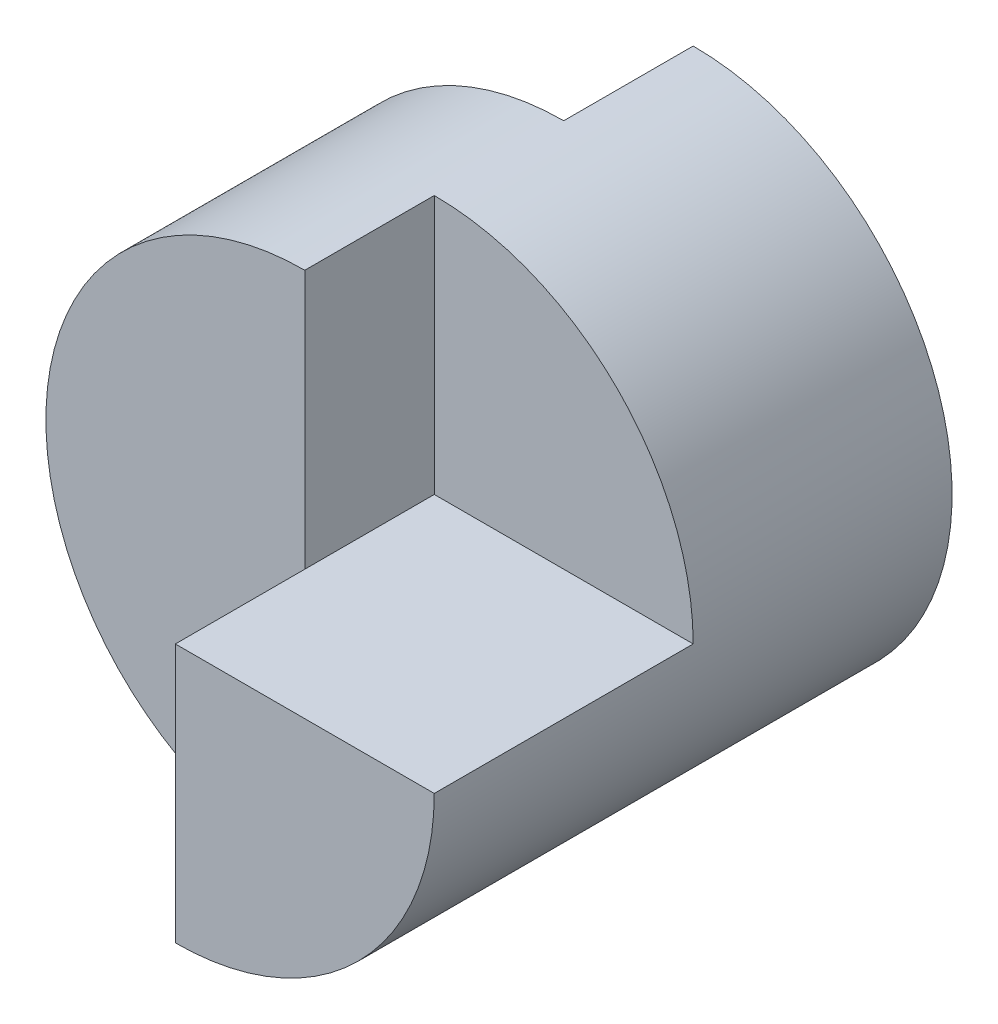
ISO-10303-21;
HEADER;
FILE_DESCRIPTION(('STEP AP214'),'2;1');
FILE_NAME('part.step','',(''),(''),'','','');
FILE_SCHEMA(('AUTOMOTIVE_DESIGN { 1 0 10303 214 1 1 1 1 }'));
ENDSEC;
DATA;
#1=APPLICATION_CONTEXT('core data for automotive mechanical design processes');
#2=APPLICATION_PROTOCOL_DEFINITION('international standard','automotive_design',2000,#1);
#3=PRODUCT_CONTEXT('',#1,'mechanical');
#4=PRODUCT('Part','Part','',(#3));
#5=PRODUCT_RELATED_PRODUCT_CATEGORY('part','',(#4));
#6=PRODUCT_DEFINITION_FORMATION('','',#4);
#7=PRODUCT_DEFINITION_CONTEXT('part definition',#1,'design');
#8=PRODUCT_DEFINITION('design','',#6,#7);
#9=PRODUCT_DEFINITION_SHAPE('','',#8);
#10=(LENGTH_UNIT() NAMED_UNIT(*) SI_UNIT(.MILLI.,.METRE.));
#11=(NAMED_UNIT(*) PLANE_ANGLE_UNIT() SI_UNIT($,.RADIAN.));
#12=(NAMED_UNIT(*) SI_UNIT($,.STERADIAN.) SOLID_ANGLE_UNIT());
#13=UNCERTAINTY_MEASURE_WITH_UNIT(LENGTH_MEASURE(1.E-05),#10,'distance_accuracy_value','');
#14=(GEOMETRIC_REPRESENTATION_CONTEXT(3) GLOBAL_UNCERTAINTY_ASSIGNED_CONTEXT((#13)) GLOBAL_UNIT_ASSIGNED_CONTEXT((#10,
#11,#12)) REPRESENTATION_CONTEXT('',''));
#15=CARTESIAN_POINT('',(0.,0.,0.));
#16=DIRECTION('',(0.,0.,1.));
#17=DIRECTION('',(1.,0.,0.));
#18=AXIS2_PLACEMENT_3D('',#15,#16,#17);
#19=CARTESIAN_POINT('',(0.,0.,40.));
#20=DIRECTION('',(0.,0.,-1.));
#21=DIRECTION('',(-1.,0.,0.));
#22=AXIS2_PLACEMENT_3D('',#19,#20,#21);
#23=CYLINDRICAL_SURFACE('',#22,20.);
#24=CARTESIAN_POINT('',(0.,0.,30.));
#25=DIRECTION('',(0.,0.,1.));
#26=DIRECTION('',(1.,0.,0.));
#27=AXIS2_PLACEMENT_3D('',#24,#25,#26);
#28=CIRCLE('',#27,20.);
#29=CARTESIAN_POINT('',(0.,20.,30.));
#30=VERTEX_POINT('',#29);
#31=CARTESIAN_POINT('',(0.,-20.,30.));
#32=VERTEX_POINT('',#31);
#33=EDGE_CURVE('E40',#30,#32,#28,.T.);
#34=ORIENTED_EDGE('',*,*,#33,.F.);
#35=DIRECTION('',(0.,0.,1.));
#36=VECTOR('',#35,1.);
#37=CARTESIAN_POINT('',(0.,20.,20.));
#38=LINE('',#37,#36);
#39=CARTESIAN_POINT('',(0.,20.,20.));
#40=VERTEX_POINT('',#39);
#41=EDGE_CURVE('E111',#40,#30,#38,.T.);
#42=ORIENTED_EDGE('',*,*,#41,.F.);
#43=CARTESIAN_POINT('',(0.,0.,20.));
#44=DIRECTION('',(0.,0.,1.));
#45=DIRECTION('',(1.,0.,0.));
#46=AXIS2_PLACEMENT_3D('',#43,#44,#45);
#47=CIRCLE('',#46,20.);
#48=CARTESIAN_POINT('',(20.,0.,20.));
#49=VERTEX_POINT('',#48);
#50=EDGE_CURVE('E95',#49,#40,#47,.T.);
#51=ORIENTED_EDGE('',*,*,#50,.F.);
#52=DIRECTION('',(0.,0.,1.));
#53=VECTOR('',#52,1.);
#54=CARTESIAN_POINT('',(20.,0.,20.));
#55=LINE('',#54,#53);
#56=CARTESIAN_POINT('',(20.,0.,40.));
#57=VERTEX_POINT('',#56);
#58=EDGE_CURVE('E94',#49,#57,#55,.T.);
#59=ORIENTED_EDGE('',*,*,#58,.T.);
#60=CARTESIAN_POINT('',(0.,0.,40.));
#61=DIRECTION('',(0.,0.,1.));
#62=DIRECTION('',(1.,0.,0.));
#63=AXIS2_PLACEMENT_3D('',#60,#61,#62);
#64=CIRCLE('',#63,20.);
#65=CARTESIAN_POINT('',(0.,-20.,40.));
#66=VERTEX_POINT('',#65);
#67=EDGE_CURVE('E126',#66,#57,#64,.T.);
#68=ORIENTED_EDGE('',*,*,#67,.F.);
#69=DIRECTION('',(0.,0.,-1.));
#70=VECTOR('',#69,1.);
#71=CARTESIAN_POINT('',(0.,-20.,40.));
#72=LINE('',#71,#70);
#73=EDGE_CURVE('E116',#32,#66,#72,.F.);
#74=ORIENTED_EDGE('',*,*,#73,.F.);
#75=EDGE_LOOP('',(#34,#42,#51,#59,#68,#74));
#76=FACE_BOUND('',#75,.T.);
#77=DIRECTION('',(0.,0.,-1.));
#78=VECTOR('',#77,1.);
#79=CARTESIAN_POINT('',(0.,20.,40.));
#80=LINE('',#79,#78);
#81=CARTESIAN_POINT('',(0.,20.,10.));
#82=VERTEX_POINT('',#81);
#83=CARTESIAN_POINT('',(0.,20.,0.));
#84=VERTEX_POINT('',#83);
#85=EDGE_CURVE('E123',#82,#84,#80,.T.);
#86=ORIENTED_EDGE('',*,*,#85,.F.);
#87=CARTESIAN_POINT('',(0.,0.,10.));
#88=DIRECTION('',(0.,0.,-1.));
#89=DIRECTION('',(-1.,0.,0.));
#90=AXIS2_PLACEMENT_3D('',#87,#88,#89);
#91=CIRCLE('',#90,20.);
#92=CARTESIAN_POINT('',(0.,-20.,10.));
#93=VERTEX_POINT('',#92);
#94=EDGE_CURVE('E132',#93,#82,#91,.T.);
#95=ORIENTED_EDGE('',*,*,#94,.F.);
#96=DIRECTION('',(0.,0.,-1.));
#97=VECTOR('',#96,1.);
#98=CARTESIAN_POINT('',(0.,-20.,40.));
#99=LINE('',#98,#97);
#100=CARTESIAN_POINT('',(0.,-20.,0.));
#101=VERTEX_POINT('',#100);
#102=EDGE_CURVE('E121',#101,#93,#99,.F.);
#103=ORIENTED_EDGE('',*,*,#102,.F.);
#104=CARTESIAN_POINT('',(0.,0.,0.));
#105=DIRECTION('',(0.,0.,1.));
#106=DIRECTION('',(1.,0.,0.));
#107=AXIS2_PLACEMENT_3D('',#104,#105,#106);
#108=CIRCLE('',#107,20.);
#109=EDGE_CURVE('E125',#101,#84,#108,.T.);
#110=ORIENTED_EDGE('',*,*,#109,.T.);
#111=EDGE_LOOP('',(#86,#95,#103,#110));
#112=FACE_BOUND('',#111,.T.);
#113=ADVANCED_FACE('F33',(#76,#112),#23,.T.);
#114=CARTESIAN_POINT('',(0.,0.,40.));
#115=DIRECTION('',(0.,0.,1.));
#116=DIRECTION('',(1.,0.,0.));
#117=AXIS2_PLACEMENT_3D('',#114,#115,#116);
#118=PLANE('',#117);
#119=DIRECTION('',(1.,0.,0.));
#120=VECTOR('',#119,1.);
#121=CARTESIAN_POINT('',(0.,0.,40.));
#122=LINE('',#121,#120);
#123=CARTESIAN_POINT('',(0.,0.,40.));
#124=VERTEX_POINT('',#123);
#125=EDGE_CURVE('E106',#124,#57,#122,.T.);
#126=ORIENTED_EDGE('',*,*,#125,.F.);
#127=DIRECTION('',(0.,-1.,0.));
#128=VECTOR('',#127,1.);
#129=CARTESIAN_POINT('',(0.,0.,40.));
#130=LINE('',#129,#128);
#131=EDGE_CURVE('E54',#124,#66,#130,.T.);
#132=ORIENTED_EDGE('',*,*,#131,.T.);
#133=ORIENTED_EDGE('',*,*,#67,.T.);
#134=EDGE_LOOP('',(#126,#132,#133));
#135=FACE_BOUND('',#134,.T.);
#136=ADVANCED_FACE('F145',(#135),#118,.T.);
#137=CARTESIAN_POINT('',(0.,0.,0.));
#138=DIRECTION('',(0.,0.,1.));
#139=DIRECTION('',(1.,0.,0.));
#140=AXIS2_PLACEMENT_3D('',#137,#138,#139);
#141=PLANE('',#140);
#142=DIRECTION('',(0.,-1.,0.));
#143=VECTOR('',#142,1.);
#144=CARTESIAN_POINT('',(0.,0.,0.));
#145=LINE('',#144,#143);
#146=EDGE_CURVE('E128',#84,#101,#145,.T.);
#147=ORIENTED_EDGE('',*,*,#146,.F.);
#148=ORIENTED_EDGE('',*,*,#109,.F.);
#149=EDGE_LOOP('',(#147,#148));
#150=FACE_BOUND('',#149,.T.);
#151=ADVANCED_FACE('F147',(#150),#141,.F.);
#152=CARTESIAN_POINT('',(-20.,40.,10.));
#153=DIRECTION('',(0.,0.,-1.));
#154=DIRECTION('',(-1.,0.,0.));
#155=AXIS2_PLACEMENT_3D('',#152,#153,#154);
#156=PLANE('',#155);
#157=ORIENTED_EDGE('',*,*,#94,.T.);
#158=DIRECTION('',(0.,-1.,0.));
#159=VECTOR('',#158,1.);
#160=CARTESIAN_POINT('',(0.,40.,10.));
#161=LINE('',#160,#159);
#162=EDGE_CURVE('E118',#82,#93,#161,.T.);
#163=ORIENTED_EDGE('',*,*,#162,.T.);
#164=EDGE_LOOP('',(#157,#163));
#165=FACE_BOUND('',#164,.T.);
#166=ADVANCED_FACE('F153',(#165),#156,.T.);
#167=CARTESIAN_POINT('',(0.,40.,0.));
#168=DIRECTION('',(-1.,0.,0.));
#169=DIRECTION('',(0.,0.,1.));
#170=AXIS2_PLACEMENT_3D('',#167,#168,#169);
#171=PLANE('',#170);
#172=ORIENTED_EDGE('',*,*,#85,.T.);
#173=ORIENTED_EDGE('',*,*,#146,.T.);
#174=ORIENTED_EDGE('',*,*,#102,.T.);
#175=ORIENTED_EDGE('',*,*,#162,.F.);
#176=EDGE_LOOP('',(#172,#173,#174,#175));
#177=FACE_BOUND('',#176,.T.);
#178=ADVANCED_FACE('F158',(#177),#171,.T.);
#179=CARTESIAN_POINT('',(-20.,40.,30.));
#180=DIRECTION('',(0.,0.,1.));
#181=DIRECTION('',(1.,0.,0.));
#182=AXIS2_PLACEMENT_3D('',#179,#180,#181);
#183=PLANE('',#182);
#184=DIRECTION('',(0.,-1.,0.));
#185=VECTOR('',#184,1.);
#186=CARTESIAN_POINT('',(0.,40.,30.));
#187=LINE('',#186,#185);
#188=CARTESIAN_POINT('',(0.,0.,30.));
#189=VERTEX_POINT('',#188);
#190=EDGE_CURVE('E92',#30,#189,#187,.T.);
#191=ORIENTED_EDGE('',*,*,#190,.F.);
#192=ORIENTED_EDGE('',*,*,#33,.T.);
#193=EDGE_CURVE('E113',#189,#32,#187,.T.);
#194=ORIENTED_EDGE('',*,*,#193,.F.);
#195=EDGE_LOOP('',(#191,#192,#194));
#196=FACE_BOUND('',#195,.T.);
#197=ADVANCED_FACE('F139',(#196),#183,.T.);
#198=CARTESIAN_POINT('',(0.,40.,40.));
#199=DIRECTION('',(-1.,0.,0.));
#200=DIRECTION('',(0.,0.,1.));
#201=AXIS2_PLACEMENT_3D('',#198,#199,#200);
#202=PLANE('',#201);
#203=DIRECTION('',(0.,0.,1.));
#204=VECTOR('',#203,1.);
#205=CARTESIAN_POINT('',(0.,0.,40.));
#206=LINE('',#205,#204);
#207=EDGE_CURVE('E11',#189,#124,#206,.T.);
#208=ORIENTED_EDGE('',*,*,#207,.F.);
#209=ORIENTED_EDGE('',*,*,#193,.T.);
#210=ORIENTED_EDGE('',*,*,#73,.T.);
#211=ORIENTED_EDGE('',*,*,#131,.F.);
#212=EDGE_LOOP('',(#208,#209,#210,#211));
#213=FACE_BOUND('',#212,.T.);
#214=ADVANCED_FACE('F144',(#213),#202,.T.);
#215=CARTESIAN_POINT('',(0.,0.,20.));
#216=DIRECTION('',(-1.,0.,0.));
#217=DIRECTION('',(0.,-1.,0.));
#218=AXIS2_PLACEMENT_3D('',#215,#216,#217);
#219=PLANE('',#218);
#220=ORIENTED_EDGE('',*,*,#190,.T.);
#221=DIRECTION('',(0.,0.,1.));
#222=VECTOR('',#221,1.);
#223=CARTESIAN_POINT('',(0.,0.,20.));
#224=LINE('',#223,#222);
#225=CARTESIAN_POINT('',(0.,0.,20.));
#226=VERTEX_POINT('',#225);
#227=EDGE_CURVE('E46',#226,#189,#224,.T.);
#228=ORIENTED_EDGE('',*,*,#227,.F.);
#229=DIRECTION('',(0.,-1.,0.));
#230=VECTOR('',#229,1.);
#231=CARTESIAN_POINT('',(0.,0.,20.));
#232=LINE('',#231,#230);
#233=EDGE_CURVE('E89',#40,#226,#232,.T.);
#234=ORIENTED_EDGE('',*,*,#233,.F.);
#235=ORIENTED_EDGE('',*,*,#41,.T.);
#236=EDGE_LOOP('',(#220,#228,#234,#235));
#237=FACE_BOUND('',#236,.T.);
#238=ADVANCED_FACE('F87',(#237),#219,.F.);
#239=CARTESIAN_POINT('',(0.,0.,20.));
#240=DIRECTION('',(0.,-1.,0.));
#241=DIRECTION('',(0.,0.,-1.));
#242=AXIS2_PLACEMENT_3D('',#239,#240,#241);
#243=PLANE('',#242);
#244=ORIENTED_EDGE('',*,*,#125,.T.);
#245=ORIENTED_EDGE('',*,*,#58,.F.);
#246=DIRECTION('',(1.,0.,0.));
#247=VECTOR('',#246,1.);
#248=CARTESIAN_POINT('',(0.,0.,20.));
#249=LINE('',#248,#247);
#250=EDGE_CURVE('E98',#226,#49,#249,.T.);
#251=ORIENTED_EDGE('',*,*,#250,.F.);
#252=ORIENTED_EDGE('',*,*,#227,.T.);
#253=ORIENTED_EDGE('',*,*,#207,.T.);
#254=EDGE_LOOP('',(#244,#245,#251,#252,#253));
#255=FACE_BOUND('',#254,.T.);
#256=ADVANCED_FACE('F99',(#255),#243,.F.);
#257=CARTESIAN_POINT('',(0.,0.,20.));
#258=DIRECTION('',(0.,0.,1.));
#259=DIRECTION('',(1.,0.,0.));
#260=AXIS2_PLACEMENT_3D('',#257,#258,#259);
#261=PLANE('',#260);
#262=ORIENTED_EDGE('',*,*,#233,.T.);
#263=ORIENTED_EDGE('',*,*,#250,.T.);
#264=ORIENTED_EDGE('',*,*,#50,.T.);
#265=EDGE_LOOP('',(#262,#263,#264));
#266=FACE_BOUND('',#265,.T.);
#267=ADVANCED_FACE('F104',(#266),#261,.T.);
#268=CLOSED_SHELL('',(#113,#136,#151,#166,#178,#197,#214,#238,#256,#267));
#269=MANIFOLD_SOLID_BREP('B2',#268);
#270=ADVANCED_BREP_SHAPE_REPRESENTATION('',(#18,#269),#14);
#271=SHAPE_DEFINITION_REPRESENTATION(#9,#270);
ENDSEC;
END-ISO-10303-21;
